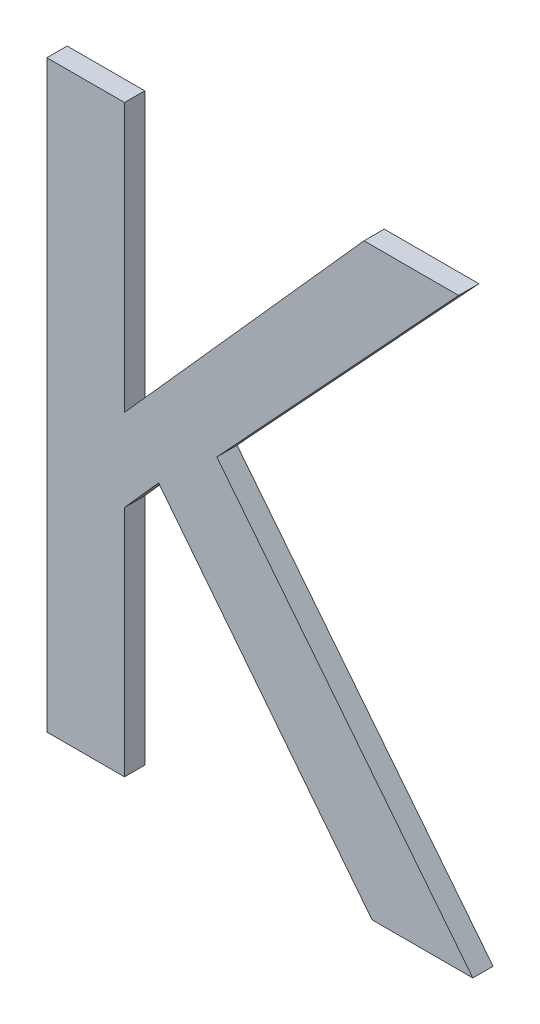
ISO-10303-21;
HEADER;
FILE_DESCRIPTION(('STEP AP214'),'2;1');
FILE_NAME('part.step','',(''),(''),'','','');
FILE_SCHEMA(('AUTOMOTIVE_DESIGN { 1 0 10303 214 1 1 1 1 }'));
ENDSEC;
DATA;
#1=APPLICATION_CONTEXT('core data for automotive mechanical design processes');
#2=APPLICATION_PROTOCOL_DEFINITION('international standard','automotive_design',2000,#1);
#3=PRODUCT_CONTEXT('',#1,'mechanical');
#4=PRODUCT('Part','Part','',(#3));
#5=PRODUCT_RELATED_PRODUCT_CATEGORY('part','',(#4));
#6=PRODUCT_DEFINITION_FORMATION('','',#4);
#7=PRODUCT_DEFINITION_CONTEXT('part definition',#1,'design');
#8=PRODUCT_DEFINITION('design','',#6,#7);
#9=PRODUCT_DEFINITION_SHAPE('','',#8);
#10=(LENGTH_UNIT() NAMED_UNIT(*) SI_UNIT(.MILLI.,.METRE.));
#11=(NAMED_UNIT(*) PLANE_ANGLE_UNIT() SI_UNIT($,.RADIAN.));
#12=(NAMED_UNIT(*) SI_UNIT($,.STERADIAN.) SOLID_ANGLE_UNIT());
#13=UNCERTAINTY_MEASURE_WITH_UNIT(LENGTH_MEASURE(1.E-05),#10,'distance_accuracy_value','');
#14=(GEOMETRIC_REPRESENTATION_CONTEXT(3) GLOBAL_UNCERTAINTY_ASSIGNED_CONTEXT((#13)) GLOBAL_UNIT_ASSIGNED_CONTEXT((#10,
#11,#12)) REPRESENTATION_CONTEXT('',''));
#15=CARTESIAN_POINT('',(0.,0.,0.));
#16=DIRECTION('',(0.,0.,1.));
#17=DIRECTION('',(1.,0.,0.));
#18=AXIS2_PLACEMENT_3D('',#15,#16,#17);
#19=CARTESIAN_POINT('',(-1.04082041955957,-1.31817928541644,0.0042));
#20=DIRECTION('',(0.,0.,1.));
#21=DIRECTION('',(1.,0.,0.));
#22=AXIS2_PLACEMENT_3D('',#19,#20,#21);
#23=PLANE('',#22);
#24=DIRECTION('',(1.,0.,0.));
#25=VECTOR('',#24,1.);
#26=CARTESIAN_POINT('',(-1.01430904399038,-1.36741416257148,0.0042));
#27=LINE('',#26,#25);
#28=CARTESIAN_POINT('',(-1.01430904399038,-1.36741416257148,0.0042));
#29=VERTEX_POINT('',#28);
#30=CARTESIAN_POINT('',(-0.997393323201014,-1.36741416257148,0.0042));
#31=VERTEX_POINT('',#30);
#32=EDGE_CURVE('E11',#29,#31,#27,.T.);
#33=ORIENTED_EDGE('',*,*,#32,.T.);
#34=DIRECTION('',(-0.620908701570166,0.783882889412985,0.));
#35=VECTOR('',#34,1.);
#36=CARTESIAN_POINT('',(-0.997393323201014,-1.36741416257148,0.0042));
#37=LINE('',#36,#35);
#38=CARTESIAN_POINT('',(-1.04035766567542,-1.31317267290416,0.0042));
#39=VERTEX_POINT('',#38);
#40=EDGE_CURVE('E119',#31,#39,#37,.T.);
#41=ORIENTED_EDGE('',*,*,#40,.T.);
#42=DIRECTION('',(0.679991598104566,0.733219903239948,0.));
#43=VECTOR('',#42,1.);
#44=CARTESIAN_POINT('',(-1.04035766567542,-1.31317267290416,0.0042));
#45=LINE('',#44,#43);
#46=CARTESIAN_POINT('',(-0.999775819086841,-1.26941416513448,0.0042));
#47=VERTEX_POINT('',#46);
#48=EDGE_CURVE('E192',#39,#47,#45,.T.);
#49=ORIENTED_EDGE('',*,*,#48,.T.);
#50=DIRECTION('',(-1.,0.,0.));
#51=VECTOR('',#50,1.);
#52=CARTESIAN_POINT('',(-0.999775819086841,-1.26941416513448,0.0042));
#53=LINE('',#52,#51);
#54=CARTESIAN_POINT('',(-1.01565912499235,-1.26941416513448,0.0042));
#55=VERTEX_POINT('',#54);
#56=EDGE_CURVE('E183',#47,#55,#53,.T.);
#57=ORIENTED_EDGE('',*,*,#56,.T.);
#58=DIRECTION('',(-0.665832703491979,-0.746101072885277,0.));
#59=VECTOR('',#58,1.);
#60=CARTESIAN_POINT('',(-1.01565912499235,-1.26941416513448,0.0042));
#61=LINE('',#60,#59);
#62=CARTESIAN_POINT('',(-1.05584388893329,-1.3144433373766,0.0042));
#63=VERTEX_POINT('',#62);
#64=EDGE_CURVE('E173',#55,#63,#61,.T.);
#65=ORIENTED_EDGE('',*,*,#64,.T.);
#66=DIRECTION('',(0.,1.,0.));
#67=VECTOR('',#66,1.);
#68=CARTESIAN_POINT('',(-1.05584388893329,-1.3144433373766,0.0042));
#69=LINE('',#68,#67);
#70=CARTESIAN_POINT('',(-1.05584388893329,-1.26941416513448,0.0042));
#71=VERTEX_POINT('',#70);
#72=EDGE_CURVE('E163',#63,#71,#69,.T.);
#73=ORIENTED_EDGE('',*,*,#72,.T.);
#74=DIRECTION('',(-1.,0.,0.));
#75=VECTOR('',#74,1.);
#76=CARTESIAN_POINT('',(-1.05584388893329,-1.26941416513448,0.0042));
#77=LINE('',#76,#75);
#78=CARTESIAN_POINT('',(-1.06886819977581,-1.26941416513448,0.0042));
#79=VERTEX_POINT('',#78);
#80=EDGE_CURVE('E153',#71,#79,#77,.T.);
#81=ORIENTED_EDGE('',*,*,#80,.T.);
#82=DIRECTION('',(0.,-1.,0.));
#83=VECTOR('',#82,1.);
#84=CARTESIAN_POINT('',(-1.06886819977581,-1.26941416513448,0.0042));
#85=LINE('',#84,#83);
#86=CARTESIAN_POINT('',(-1.06886819977581,-1.36741416257148,0.0042));
#87=VERTEX_POINT('',#86);
#88=EDGE_CURVE('E144',#79,#87,#85,.T.);
#89=ORIENTED_EDGE('',*,*,#88,.T.);
#90=DIRECTION('',(1.,0.,0.));
#91=VECTOR('',#90,1.);
#92=CARTESIAN_POINT('',(-1.06886819977581,-1.36741416257148,0.0042));
#93=LINE('',#92,#91);
#94=CARTESIAN_POINT('',(-1.05584388893329,-1.36741416257148,0.0042));
#95=VERTEX_POINT('',#94);
#96=EDGE_CURVE('E155',#87,#95,#93,.T.);
#97=ORIENTED_EDGE('',*,*,#96,.T.);
#98=DIRECTION('',(0.,1.,0.));
#99=VECTOR('',#98,1.);
#100=CARTESIAN_POINT('',(-1.05584388893329,-1.36741416257148,0.0042));
#101=LINE('',#100,#99);
#102=CARTESIAN_POINT('',(-1.05584388893329,-1.3282618135144,0.0042));
#103=VERTEX_POINT('',#102);
#104=EDGE_CURVE('E165',#95,#103,#101,.T.);
#105=ORIENTED_EDGE('',*,*,#104,.T.);
#106=DIRECTION('',(0.664363838829926,0.747409318683654,0.));
#107=VECTOR('',#106,1.);
#108=CARTESIAN_POINT('',(-1.05584388893329,-1.3282618135144,0.0042));
#109=LINE('',#108,#107);
#110=CARTESIAN_POINT('',(-1.05012589880731,-1.32182907462266,0.0042));
#111=VERTEX_POINT('',#110);
#112=EDGE_CURVE('E175',#103,#111,#109,.T.);
#113=ORIENTED_EDGE('',*,*,#112,.T.);
#114=DIRECTION('',(0.617821551931899,-0.786318338822426,0.));
#115=VECTOR('',#114,1.);
#116=CARTESIAN_POINT('',(-1.05012589880731,-1.32182907462266,0.0042));
#117=LINE('',#116,#115);
#118=EDGE_CURVE('E185',#111,#29,#117,.T.);
#119=ORIENTED_EDGE('',*,*,#118,.T.);
#120=EDGE_LOOP('',(#33,#41,#49,#57,#65,#73,#81,#89,#97,#105,#113,#119));
#121=FACE_BOUND('',#120,.T.);
#122=ADVANCED_FACE('F17',(#121),#23,.T.);
#123=CARTESIAN_POINT('',(-1.05012589880731,-1.32182907462266,0.0008));
#124=DIRECTION('',(-0.786318338822423,-0.617821551931904,0.));
#125=DIRECTION('',(0.617821551931904,-0.786318338822423,0.));
#126=AXIS2_PLACEMENT_3D('',#123,#124,#125);
#127=PLANE('',#126);
#128=DIRECTION('',(-0.617821551931903,0.786318338822423,0.));
#129=VECTOR('',#128,1.);
#130=CARTESIAN_POINT('',(-1.01430904399038,-1.36741416257148,0.0008));
#131=LINE('',#130,#129);
#132=CARTESIAN_POINT('',(-1.01430904399038,-1.36741416257148,0.0008));
#133=VERTEX_POINT('',#132);
#134=CARTESIAN_POINT('',(-1.05012589880731,-1.32182907462266,0.0008));
#135=VERTEX_POINT('',#134);
#136=EDGE_CURVE('E24',#133,#135,#131,.T.);
#137=ORIENTED_EDGE('',*,*,#136,.F.);
#138=DIRECTION('',(0.,0.,1.));
#139=VECTOR('',#138,1.);
#140=CARTESIAN_POINT('',(-1.01430904399038,-1.36741416257148,0.0008));
#141=LINE('',#140,#139);
#142=EDGE_CURVE('E108',#133,#29,#141,.T.);
#143=ORIENTED_EDGE('',*,*,#142,.T.);
#144=ORIENTED_EDGE('',*,*,#118,.F.);
#145=DIRECTION('',(0.,0.,1.));
#146=VECTOR('',#145,1.);
#147=CARTESIAN_POINT('',(-1.05012589880731,-1.32182907462266,0.0008));
#148=LINE('',#147,#146);
#149=EDGE_CURVE('E187',#135,#111,#148,.T.);
#150=ORIENTED_EDGE('',*,*,#149,.F.);
#151=EDGE_LOOP('',(#137,#143,#144,#150));
#152=FACE_BOUND('',#151,.T.);
#153=ADVANCED_FACE('F203',(#152),#127,.T.);
#154=CARTESIAN_POINT('',(-1.05584388893329,-1.3282618135144,0.0008));
#155=DIRECTION('',(0.747409318683659,-0.664363838829921,0.));
#156=DIRECTION('',(0.664363838829921,0.747409318683659,0.));
#157=AXIS2_PLACEMENT_3D('',#154,#155,#156);
#158=PLANE('',#157);
#159=DIRECTION('',(-0.664363838829912,-0.747409318683667,0.));
#160=VECTOR('',#159,1.);
#161=CARTESIAN_POINT('',(-1.05012589880731,-1.32182907462266,0.0008));
#162=LINE('',#161,#160);
#163=CARTESIAN_POINT('',(-1.05584388893329,-1.3282618135144,0.0008));
#164=VERTEX_POINT('',#163);
#165=EDGE_CURVE('E195',#135,#164,#162,.T.);
#166=ORIENTED_EDGE('',*,*,#165,.F.);
#167=ORIENTED_EDGE('',*,*,#149,.T.);
#168=ORIENTED_EDGE('',*,*,#112,.F.);
#169=DIRECTION('',(0.,0.,1.));
#170=VECTOR('',#169,1.);
#171=CARTESIAN_POINT('',(-1.05584388893329,-1.3282618135144,0.0008));
#172=LINE('',#171,#170);
#173=EDGE_CURVE('E178',#164,#103,#172,.T.);
#174=ORIENTED_EDGE('',*,*,#173,.F.);
#175=EDGE_LOOP('',(#166,#167,#168,#174));
#176=FACE_BOUND('',#175,.T.);
#177=ADVANCED_FACE('F200',(#176),#158,.T.);
#178=CARTESIAN_POINT('',(-1.05584388893329,-1.36741416257148,0.0008));
#179=DIRECTION('',(1.,0.,0.));
#180=DIRECTION('',(0.,1.,0.));
#181=AXIS2_PLACEMENT_3D('',#178,#179,#180);
#182=PLANE('',#181);
#183=DIRECTION('',(0.,-1.,0.));
#184=VECTOR('',#183,1.);
#185=CARTESIAN_POINT('',(-1.05584388893329,-1.3282618135144,0.0008));
#186=LINE('',#185,#184);
#187=CARTESIAN_POINT('',(-1.05584388893329,-1.36741416257148,0.0008));
#188=VERTEX_POINT('',#187);
#189=EDGE_CURVE('E189',#164,#188,#186,.T.);
#190=ORIENTED_EDGE('',*,*,#189,.F.);
#191=ORIENTED_EDGE('',*,*,#173,.T.);
#192=ORIENTED_EDGE('',*,*,#104,.F.);
#193=DIRECTION('',(0.,0.,1.));
#194=VECTOR('',#193,1.);
#195=CARTESIAN_POINT('',(-1.05584388893329,-1.36741416257148,0.0008));
#196=LINE('',#195,#194);
#197=EDGE_CURVE('E168',#188,#95,#196,.T.);
#198=ORIENTED_EDGE('',*,*,#197,.F.);
#199=EDGE_LOOP('',(#190,#191,#192,#198));
#200=FACE_BOUND('',#199,.T.);
#201=ADVANCED_FACE('F208',(#200),#182,.T.);
#202=CARTESIAN_POINT('',(-1.06886819977581,-1.36741416257148,0.0008));
#203=DIRECTION('',(0.,-1.,0.));
#204=DIRECTION('',(1.,0.,0.));
#205=AXIS2_PLACEMENT_3D('',#202,#203,#204);
#206=PLANE('',#205);
#207=DIRECTION('',(-1.,0.,0.));
#208=VECTOR('',#207,1.);
#209=CARTESIAN_POINT('',(-1.05584388893329,-1.36741416257148,0.0008));
#210=LINE('',#209,#208);
#211=CARTESIAN_POINT('',(-1.06886819977581,-1.36741416257148,0.0008));
#212=VERTEX_POINT('',#211);
#213=EDGE_CURVE('E180',#188,#212,#210,.T.);
#214=ORIENTED_EDGE('',*,*,#213,.F.);
#215=ORIENTED_EDGE('',*,*,#197,.T.);
#216=ORIENTED_EDGE('',*,*,#96,.F.);
#217=DIRECTION('',(0.,0.,1.));
#218=VECTOR('',#217,1.);
#219=CARTESIAN_POINT('',(-1.06886819977581,-1.36741416257148,0.0008));
#220=LINE('',#219,#218);
#221=EDGE_CURVE('E158',#212,#87,#220,.T.);
#222=ORIENTED_EDGE('',*,*,#221,.F.);
#223=EDGE_LOOP('',(#214,#215,#216,#222));
#224=FACE_BOUND('',#223,.T.);
#225=ADVANCED_FACE('F210',(#224),#206,.T.);
#226=CARTESIAN_POINT('',(-1.06886819977581,-1.26941416513448,0.0008));
#227=DIRECTION('',(-1.,0.,0.));
#228=DIRECTION('',(0.,-1.,0.));
#229=AXIS2_PLACEMENT_3D('',#226,#227,#228);
#230=PLANE('',#229);
#231=DIRECTION('',(0.,1.,0.));
#232=VECTOR('',#231,1.);
#233=CARTESIAN_POINT('',(-1.06886819977581,-1.36741416257148,0.0008));
#234=LINE('',#233,#232);
#235=CARTESIAN_POINT('',(-1.06886819977581,-1.26941416513448,0.0008));
#236=VERTEX_POINT('',#235);
#237=EDGE_CURVE('E170',#212,#236,#234,.T.);
#238=ORIENTED_EDGE('',*,*,#237,.F.);
#239=ORIENTED_EDGE('',*,*,#221,.T.);
#240=ORIENTED_EDGE('',*,*,#88,.F.);
#241=DIRECTION('',(0.,0.,1.));
#242=VECTOR('',#241,1.);
#243=CARTESIAN_POINT('',(-1.06886819977581,-1.26941416513448,0.0008));
#244=LINE('',#243,#242);
#245=EDGE_CURVE('E147',#236,#79,#244,.T.);
#246=ORIENTED_EDGE('',*,*,#245,.F.);
#247=EDGE_LOOP('',(#238,#239,#240,#246));
#248=FACE_BOUND('',#247,.T.);
#249=ADVANCED_FACE('F214',(#248),#230,.T.);
#250=CARTESIAN_POINT('',(-1.05584388893329,-1.26941416513448,0.0008));
#251=DIRECTION('',(0.,1.,0.));
#252=DIRECTION('',(-1.,0.,0.));
#253=AXIS2_PLACEMENT_3D('',#250,#251,#252);
#254=PLANE('',#253);
#255=DIRECTION('',(1.,0.,0.));
#256=VECTOR('',#255,1.);
#257=CARTESIAN_POINT('',(-1.06886819977581,-1.26941416513448,0.0008));
#258=LINE('',#257,#256);
#259=CARTESIAN_POINT('',(-1.05584388893329,-1.26941416513448,0.0008));
#260=VERTEX_POINT('',#259);
#261=EDGE_CURVE('E160',#236,#260,#258,.T.);
#262=ORIENTED_EDGE('',*,*,#261,.F.);
#263=ORIENTED_EDGE('',*,*,#245,.T.);
#264=ORIENTED_EDGE('',*,*,#80,.F.);
#265=DIRECTION('',(0.,0.,1.));
#266=VECTOR('',#265,1.);
#267=CARTESIAN_POINT('',(-1.05584388893329,-1.26941416513448,0.0008));
#268=LINE('',#267,#266);
#269=EDGE_CURVE('E138',#260,#71,#268,.T.);
#270=ORIENTED_EDGE('',*,*,#269,.F.);
#271=EDGE_LOOP('',(#262,#263,#264,#270));
#272=FACE_BOUND('',#271,.T.);
#273=ADVANCED_FACE('F218',(#272),#254,.T.);
#274=CARTESIAN_POINT('',(-1.05584388893329,-1.3144433373766,0.0008));
#275=DIRECTION('',(1.,0.,0.));
#276=DIRECTION('',(0.,1.,0.));
#277=AXIS2_PLACEMENT_3D('',#274,#275,#276);
#278=PLANE('',#277);
#279=DIRECTION('',(0.,-1.,0.));
#280=VECTOR('',#279,1.);
#281=CARTESIAN_POINT('',(-1.05584388893329,-1.26941416513448,0.0008));
#282=LINE('',#281,#280);
#283=CARTESIAN_POINT('',(-1.05584388893329,-1.3144433373766,0.0008));
#284=VERTEX_POINT('',#283);
#285=EDGE_CURVE('E150',#260,#284,#282,.T.);
#286=ORIENTED_EDGE('',*,*,#285,.F.);
#287=ORIENTED_EDGE('',*,*,#269,.T.);
#288=ORIENTED_EDGE('',*,*,#72,.F.);
#289=DIRECTION('',(0.,0.,1.));
#290=VECTOR('',#289,1.);
#291=CARTESIAN_POINT('',(-1.05584388893329,-1.3144433373766,0.0008));
#292=LINE('',#291,#290);
#293=EDGE_CURVE('E133',#284,#63,#292,.T.);
#294=ORIENTED_EDGE('',*,*,#293,.F.);
#295=EDGE_LOOP('',(#286,#287,#288,#294));
#296=FACE_BOUND('',#295,.T.);
#297=ADVANCED_FACE('F222',(#296),#278,.T.);
#298=CARTESIAN_POINT('',(-1.01565912499235,-1.26941416513448,0.0008));
#299=DIRECTION('',(-0.746101072885279,0.665832703491977,0.));
#300=DIRECTION('',(-0.665832703491977,-0.746101072885279,0.));
#301=AXIS2_PLACEMENT_3D('',#298,#299,#300);
#302=PLANE('',#301);
#303=DIRECTION('',(0.665832703491977,0.746101072885279,0.));
#304=VECTOR('',#303,1.);
#305=CARTESIAN_POINT('',(-1.05584388893329,-1.3144433373766,0.0008));
#306=LINE('',#305,#304);
#307=CARTESIAN_POINT('',(-1.01565912499235,-1.26941416513448,0.0008));
#308=VERTEX_POINT('',#307);
#309=EDGE_CURVE('E141',#284,#308,#306,.T.);
#310=ORIENTED_EDGE('',*,*,#309,.F.);
#311=ORIENTED_EDGE('',*,*,#293,.T.);
#312=ORIENTED_EDGE('',*,*,#64,.F.);
#313=DIRECTION('',(0.,0.,1.));
#314=VECTOR('',#313,1.);
#315=CARTESIAN_POINT('',(-1.01565912499235,-1.26941416513448,0.0008));
#316=LINE('',#315,#314);
#317=EDGE_CURVE('E125',#308,#55,#316,.T.);
#318=ORIENTED_EDGE('',*,*,#317,.F.);
#319=EDGE_LOOP('',(#310,#311,#312,#318));
#320=FACE_BOUND('',#319,.T.);
#321=ADVANCED_FACE('F226',(#320),#302,.T.);
#322=CARTESIAN_POINT('',(-0.999775819086841,-1.26941416513448,0.0008));
#323=DIRECTION('',(0.,1.,0.));
#324=DIRECTION('',(-1.,0.,0.));
#325=AXIS2_PLACEMENT_3D('',#322,#323,#324);
#326=PLANE('',#325);
#327=DIRECTION('',(1.,0.,0.));
#328=VECTOR('',#327,1.);
#329=CARTESIAN_POINT('',(-1.01565912499235,-1.26941416513448,0.0008));
#330=LINE('',#329,#328);
#331=CARTESIAN_POINT('',(-0.999775819086841,-1.26941416513448,0.0008));
#332=VERTEX_POINT('',#331);
#333=EDGE_CURVE('E136',#308,#332,#330,.T.);
#334=ORIENTED_EDGE('',*,*,#333,.F.);
#335=ORIENTED_EDGE('',*,*,#317,.T.);
#336=ORIENTED_EDGE('',*,*,#56,.F.);
#337=DIRECTION('',(0.,0.,1.));
#338=VECTOR('',#337,1.);
#339=CARTESIAN_POINT('',(-0.999775819086841,-1.26941416513448,0.0008));
#340=LINE('',#339,#338);
#341=EDGE_CURVE('E111',#332,#47,#340,.T.);
#342=ORIENTED_EDGE('',*,*,#341,.F.);
#343=EDGE_LOOP('',(#334,#335,#336,#342));
#344=FACE_BOUND('',#343,.T.);
#345=ADVANCED_FACE('F230',(#344),#326,.T.);
#346=CARTESIAN_POINT('',(-1.04035766567542,-1.31317267290416,0.0008));
#347=DIRECTION('',(0.73321990323995,-0.679991598104563,0.));
#348=DIRECTION('',(0.679991598104563,0.73321990323995,0.));
#349=AXIS2_PLACEMENT_3D('',#346,#347,#348);
#350=PLANE('',#349);
#351=DIRECTION('',(-0.679991598104563,-0.73321990323995,0.));
#352=VECTOR('',#351,1.);
#353=CARTESIAN_POINT('',(-0.999775819086841,-1.26941416513448,0.0008));
#354=LINE('',#353,#352);
#355=CARTESIAN_POINT('',(-1.04035766567542,-1.31317267290416,0.0008));
#356=VERTEX_POINT('',#355);
#357=EDGE_CURVE('E124',#332,#356,#354,.T.);
#358=ORIENTED_EDGE('',*,*,#357,.F.);
#359=ORIENTED_EDGE('',*,*,#341,.T.);
#360=ORIENTED_EDGE('',*,*,#48,.F.);
#361=DIRECTION('',(0.,0.,1.));
#362=VECTOR('',#361,1.);
#363=CARTESIAN_POINT('',(-1.04035766567542,-1.31317267290416,0.0008));
#364=LINE('',#363,#362);
#365=EDGE_CURVE('E112',#356,#39,#364,.T.);
#366=ORIENTED_EDGE('',*,*,#365,.F.);
#367=EDGE_LOOP('',(#358,#359,#360,#366));
#368=FACE_BOUND('',#367,.T.);
#369=ADVANCED_FACE('F234',(#368),#350,.T.);
#370=CARTESIAN_POINT('',(-0.997393323201014,-1.36741416257148,0.0008));
#371=DIRECTION('',(0.783882889412984,0.620908701570168,0.));
#372=DIRECTION('',(-0.620908701570168,0.783882889412984,0.));
#373=AXIS2_PLACEMENT_3D('',#370,#371,#372);
#374=PLANE('',#373);
#375=DIRECTION('',(0.620908701570168,-0.783882889412984,0.));
#376=VECTOR('',#375,1.);
#377=CARTESIAN_POINT('',(-1.04035766567542,-1.31317267290416,0.0008));
#378=LINE('',#377,#376);
#379=CARTESIAN_POINT('',(-0.997393323201014,-1.36741416257148,0.0008));
#380=VERTEX_POINT('',#379);
#381=EDGE_CURVE('E117',#356,#380,#378,.T.);
#382=ORIENTED_EDGE('',*,*,#381,.F.);
#383=ORIENTED_EDGE('',*,*,#365,.T.);
#384=ORIENTED_EDGE('',*,*,#40,.F.);
#385=DIRECTION('',(0.,0.,1.));
#386=VECTOR('',#385,1.);
#387=CARTESIAN_POINT('',(-0.997393323201014,-1.36741416257148,0.0008));
#388=LINE('',#387,#386);
#389=EDGE_CURVE('E106',#380,#31,#388,.T.);
#390=ORIENTED_EDGE('',*,*,#389,.F.);
#391=EDGE_LOOP('',(#382,#383,#384,#390));
#392=FACE_BOUND('',#391,.T.);
#393=ADVANCED_FACE('F115',(#392),#374,.T.);
#394=CARTESIAN_POINT('',(-1.01430904399038,-1.36741416257148,0.0008));
#395=DIRECTION('',(0.,-1.,0.));
#396=DIRECTION('',(1.,0.,0.));
#397=AXIS2_PLACEMENT_3D('',#394,#395,#396);
#398=PLANE('',#397);
#399=DIRECTION('',(-1.,0.,0.));
#400=VECTOR('',#399,1.);
#401=CARTESIAN_POINT('',(-0.997393323201014,-1.36741416257148,0.0008));
#402=LINE('',#401,#400);
#403=EDGE_CURVE('E103',#380,#133,#402,.T.);
#404=ORIENTED_EDGE('',*,*,#403,.F.);
#405=ORIENTED_EDGE('',*,*,#389,.T.);
#406=ORIENTED_EDGE('',*,*,#32,.F.);
#407=ORIENTED_EDGE('',*,*,#142,.F.);
#408=EDGE_LOOP('',(#404,#405,#406,#407));
#409=FACE_BOUND('',#408,.T.);
#410=ADVANCED_FACE('F105',(#409),#398,.T.);
#411=CARTESIAN_POINT('',(-1.04082041955957,-1.31817928541644,0.0008));
#412=DIRECTION('',(0.,0.,1.));
#413=DIRECTION('',(1.,0.,0.));
#414=AXIS2_PLACEMENT_3D('',#411,#412,#413);
#415=PLANE('',#414);
#416=ORIENTED_EDGE('',*,*,#403,.T.);
#417=ORIENTED_EDGE('',*,*,#136,.T.);
#418=ORIENTED_EDGE('',*,*,#165,.T.);
#419=ORIENTED_EDGE('',*,*,#189,.T.);
#420=ORIENTED_EDGE('',*,*,#213,.T.);
#421=ORIENTED_EDGE('',*,*,#237,.T.);
#422=ORIENTED_EDGE('',*,*,#261,.T.);
#423=ORIENTED_EDGE('',*,*,#285,.T.);
#424=ORIENTED_EDGE('',*,*,#309,.T.);
#425=ORIENTED_EDGE('',*,*,#333,.T.);
#426=ORIENTED_EDGE('',*,*,#357,.T.);
#427=ORIENTED_EDGE('',*,*,#381,.T.);
#428=EDGE_LOOP('',(#416,#417,#418,#419,#420,#421,#422,#423,#424,#425,#426,#427));
#429=FACE_BOUND('',#428,.T.);
#430=ADVANCED_FACE('F122',(#429),#415,.F.);
#431=CLOSED_SHELL('',(#122,#153,#177,#201,#225,#249,#273,#297,#321,#345,#369,#393,#410,#430));
#432=MANIFOLD_SOLID_BREP('B1',#431);
#433=ADVANCED_BREP_SHAPE_REPRESENTATION('',(#18,#432),#14);
#434=SHAPE_DEFINITION_REPRESENTATION(#9,#433);
ENDSEC;
END-ISO-10303-21;
